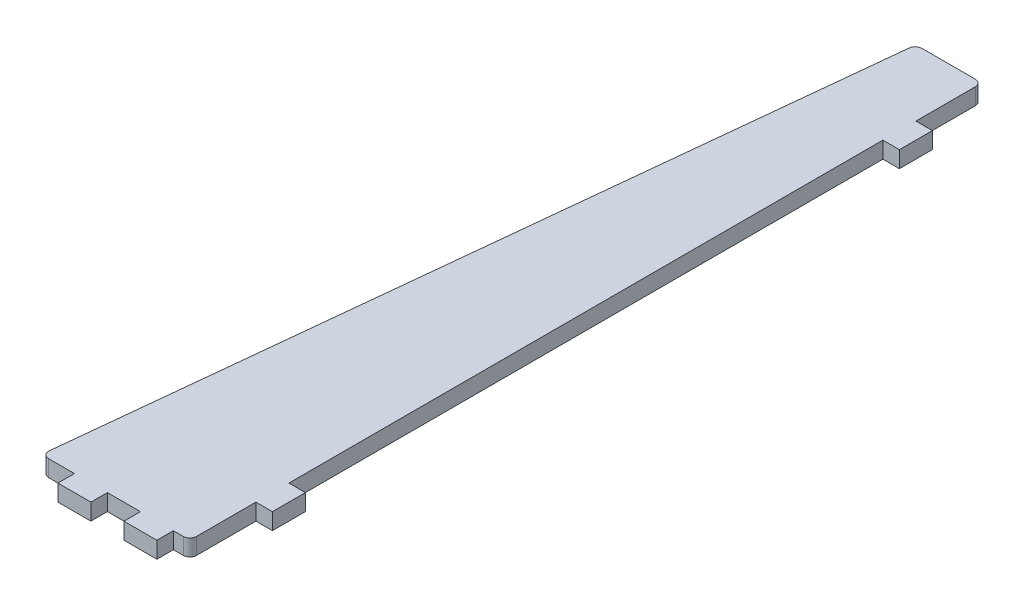
ISO-10303-21;
HEADER;
FILE_DESCRIPTION(('STEP AP214'),'2;1');
FILE_NAME('part.step','',(''),(''),'','','');
FILE_SCHEMA(('AUTOMOTIVE_DESIGN { 1 0 10303 214 1 1 1 1 }'));
ENDSEC;
DATA;
#1=APPLICATION_CONTEXT('core data for automotive mechanical design processes');
#2=APPLICATION_PROTOCOL_DEFINITION('international standard','automotive_design',2000,#1);
#3=PRODUCT_CONTEXT('',#1,'mechanical');
#4=PRODUCT('Part','Part','',(#3));
#5=PRODUCT_RELATED_PRODUCT_CATEGORY('part','',(#4));
#6=PRODUCT_DEFINITION_FORMATION('','',#4);
#7=PRODUCT_DEFINITION_CONTEXT('part definition',#1,'design');
#8=PRODUCT_DEFINITION('design','',#6,#7);
#9=PRODUCT_DEFINITION_SHAPE('','',#8);
#10=(LENGTH_UNIT() NAMED_UNIT(*) SI_UNIT(.MILLI.,.METRE.));
#11=(NAMED_UNIT(*) PLANE_ANGLE_UNIT() SI_UNIT($,.RADIAN.));
#12=(NAMED_UNIT(*) SI_UNIT($,.STERADIAN.) SOLID_ANGLE_UNIT());
#13=UNCERTAINTY_MEASURE_WITH_UNIT(LENGTH_MEASURE(1.E-05),#10,'distance_accuracy_value','');
#14=(GEOMETRIC_REPRESENTATION_CONTEXT(3) GLOBAL_UNCERTAINTY_ASSIGNED_CONTEXT((#13)) GLOBAL_UNIT_ASSIGNED_CONTEXT((#10,
#11,#12)) REPRESENTATION_CONTEXT('',''));
#15=CARTESIAN_POINT('',(0.,0.,0.));
#16=DIRECTION('',(0.,0.,1.));
#17=DIRECTION('',(1.,0.,0.));
#18=AXIS2_PLACEMENT_3D('',#15,#16,#17);
#19=CARTESIAN_POINT('',(31.75,6.35,-304.8));
#20=DIRECTION('',(0.994618408890778,0.,0.103606084259456));
#21=DIRECTION('',(0.103606084259456,0.,-0.994618408890778));
#22=AXIS2_PLACEMENT_3D('',#19,#20,#21);
#23=PLANE('',#22);
#24=DIRECTION('',(-0.103606084259456,0.,0.994618408890778));
#25=VECTOR('',#24,1.);
#26=CARTESIAN_POINT('',(31.75,6.35,-304.8));
#27=LINE('',#26,#25);
#28=CARTESIAN_POINT('',(31.5128291097936,6.35,-302.523159454019));
#29=VERTEX_POINT('',#28);
#30=CARTESIAN_POINT('',(0.291995776460316,6.35,-2.80315945401904));
#31=VERTEX_POINT('',#30);
#32=EDGE_CURVE('E205',#29,#31,#27,.T.);
#33=ORIENTED_EDGE('',*,*,#32,.F.);
#34=DIRECTION('',(0.,-1.,0.));
#35=VECTOR('',#34,1.);
#36=CARTESIAN_POINT('',(31.5128291097936,6.35,-302.523159454019));
#37=LINE('',#36,#35);
#38=CARTESIAN_POINT('',(31.5128291097936,0.,-302.523159454019));
#39=VERTEX_POINT('',#38);
#40=EDGE_CURVE('E40',#29,#39,#37,.T.);
#41=ORIENTED_EDGE('',*,*,#40,.T.);
#42=DIRECTION('',(-0.103606084259456,0.,0.994618408890778));
#43=VECTOR('',#42,1.);
#44=CARTESIAN_POINT('',(31.75,0.,-304.8));
#45=LINE('',#44,#43);
#46=CARTESIAN_POINT('',(0.291995776460316,0.,-2.80315945401904));
#47=VERTEX_POINT('',#46);
#48=EDGE_CURVE('E258',#39,#47,#45,.T.);
#49=ORIENTED_EDGE('',*,*,#48,.T.);
#50=DIRECTION('',(0.,-1.,0.));
#51=VECTOR('',#50,1.);
#52=CARTESIAN_POINT('',(0.291995776460316,6.35,-2.80315945401904));
#53=LINE('',#52,#51);
#54=EDGE_CURVE('E366',#47,#31,#53,.F.);
#55=ORIENTED_EDGE('',*,*,#54,.T.);
#56=EDGE_LOOP('',(#33,#41,#49,#55));
#57=FACE_BOUND('',#56,.T.);
#58=ADVANCED_FACE('F32',(#57),#23,.F.);
#59=CARTESIAN_POINT('',(0.,6.35,0.));
#60=DIRECTION('',(0.,0.,-1.));
#61=DIRECTION('',(-1.,0.,0.));
#62=AXIS2_PLACEMENT_3D('',#59,#60,#61);
#63=PLANE('',#62);
#64=DIRECTION('',(1.,0.,0.));
#65=VECTOR('',#64,1.);
#66=CARTESIAN_POINT('',(0.,6.35,0.));
#67=LINE('',#66,#65);
#68=CARTESIAN_POINT('',(2.81832653504289,6.35,0.));
#69=VERTEX_POINT('',#68);
#70=CARTESIAN_POINT('',(12.7,6.35,0.));
#71=VERTEX_POINT('',#70);
#72=EDGE_CURVE('E193',#69,#71,#67,.T.);
#73=ORIENTED_EDGE('',*,*,#72,.F.);
#74=DIRECTION('',(0.,-1.,0.));
#75=VECTOR('',#74,1.);
#76=CARTESIAN_POINT('',(2.81832653504289,6.35,0.));
#77=LINE('',#76,#75);
#78=CARTESIAN_POINT('',(2.81832653504289,0.,0.));
#79=VERTEX_POINT('',#78);
#80=EDGE_CURVE('E11',#69,#79,#77,.T.);
#81=ORIENTED_EDGE('',*,*,#80,.T.);
#82=DIRECTION('',(1.,0.,0.));
#83=VECTOR('',#82,1.);
#84=CARTESIAN_POINT('',(0.,0.,0.));
#85=LINE('',#84,#83);
#86=CARTESIAN_POINT('',(12.7,0.,0.));
#87=VERTEX_POINT('',#86);
#88=EDGE_CURVE('E211',#79,#87,#85,.T.);
#89=ORIENTED_EDGE('',*,*,#88,.T.);
#90=DIRECTION('',(0.,-1.,0.));
#91=VECTOR('',#90,1.);
#92=CARTESIAN_POINT('',(12.7,6.35,0.));
#93=LINE('',#92,#91);
#94=EDGE_CURVE('E208',#71,#87,#93,.T.);
#95=ORIENTED_EDGE('',*,*,#94,.F.);
#96=EDGE_LOOP('',(#73,#81,#89,#95));
#97=FACE_BOUND('',#96,.T.);
#98=ADVANCED_FACE('F209',(#97),#63,.F.);
#99=CARTESIAN_POINT('',(12.7,6.35,0.));
#100=DIRECTION('',(1.,0.,0.));
#101=DIRECTION('',(0.,0.,-1.));
#102=AXIS2_PLACEMENT_3D('',#99,#100,#101);
#103=PLANE('',#102);
#104=DIRECTION('',(0.,0.,1.));
#105=VECTOR('',#104,1.);
#106=CARTESIAN_POINT('',(12.7,0.,0.));
#107=LINE('',#106,#105);
#108=CARTESIAN_POINT('',(12.7,0.,6.35));
#109=VERTEX_POINT('',#108);
#110=EDGE_CURVE('E262',#87,#109,#107,.T.);
#111=ORIENTED_EDGE('',*,*,#110,.T.);
#112=DIRECTION('',(0.,-1.,0.));
#113=VECTOR('',#112,1.);
#114=CARTESIAN_POINT('',(12.7,6.35,6.35));
#115=LINE('',#114,#113);
#116=CARTESIAN_POINT('',(12.7,6.35,6.35));
#117=VERTEX_POINT('',#116);
#118=EDGE_CURVE('E215',#117,#109,#115,.T.);
#119=ORIENTED_EDGE('',*,*,#118,.F.);
#120=DIRECTION('',(0.,0.,1.));
#121=VECTOR('',#120,1.);
#122=CARTESIAN_POINT('',(12.7,6.35,0.));
#123=LINE('',#122,#121);
#124=EDGE_CURVE('E198',#71,#117,#123,.T.);
#125=ORIENTED_EDGE('',*,*,#124,.F.);
#126=ORIENTED_EDGE('',*,*,#94,.T.);
#127=EDGE_LOOP('',(#111,#119,#125,#126));
#128=FACE_BOUND('',#127,.T.);
#129=ADVANCED_FACE('F217',(#128),#103,.F.);
#130=CARTESIAN_POINT('',(12.7,6.35,6.35));
#131=DIRECTION('',(0.,0.,-1.));
#132=DIRECTION('',(-1.,0.,0.));
#133=AXIS2_PLACEMENT_3D('',#130,#131,#132);
#134=PLANE('',#133);
#135=DIRECTION('',(1.,0.,0.));
#136=VECTOR('',#135,1.);
#137=CARTESIAN_POINT('',(12.7,0.,6.35));
#138=LINE('',#137,#136);
#139=CARTESIAN_POINT('',(25.4,0.,6.35));
#140=VERTEX_POINT('',#139);
#141=EDGE_CURVE('E264',#109,#140,#138,.T.);
#142=ORIENTED_EDGE('',*,*,#141,.T.);
#143=DIRECTION('',(0.,-1.,0.));
#144=VECTOR('',#143,1.);
#145=CARTESIAN_POINT('',(25.4,6.35,6.35));
#146=LINE('',#145,#144);
#147=CARTESIAN_POINT('',(25.4,6.35,6.35));
#148=VERTEX_POINT('',#147);
#149=EDGE_CURVE('E338',#148,#140,#146,.T.);
#150=ORIENTED_EDGE('',*,*,#149,.F.);
#151=DIRECTION('',(1.,0.,0.));
#152=VECTOR('',#151,1.);
#153=CARTESIAN_POINT('',(12.7,6.35,6.35));
#154=LINE('',#153,#152);
#155=EDGE_CURVE('E220',#117,#148,#154,.T.);
#156=ORIENTED_EDGE('',*,*,#155,.F.);
#157=ORIENTED_EDGE('',*,*,#118,.T.);
#158=EDGE_LOOP('',(#142,#150,#156,#157));
#159=FACE_BOUND('',#158,.T.);
#160=ADVANCED_FACE('F500',(#159),#134,.F.);
#161=CARTESIAN_POINT('',(25.4,6.35,6.35));
#162=DIRECTION('',(-1.,0.,0.));
#163=DIRECTION('',(0.,0.,1.));
#164=AXIS2_PLACEMENT_3D('',#161,#162,#163);
#165=PLANE('',#164);
#166=DIRECTION('',(0.,0.,-1.));
#167=VECTOR('',#166,1.);
#168=CARTESIAN_POINT('',(25.4,0.,6.35));
#169=LINE('',#168,#167);
#170=CARTESIAN_POINT('',(25.4,0.,0.));
#171=VERTEX_POINT('',#170);
#172=EDGE_CURVE('E266',#140,#171,#169,.T.);
#173=ORIENTED_EDGE('',*,*,#172,.T.);
#174=DIRECTION('',(0.,-1.,0.));
#175=VECTOR('',#174,1.);
#176=CARTESIAN_POINT('',(25.4,6.35,0.));
#177=LINE('',#176,#175);
#178=CARTESIAN_POINT('',(25.4,6.35,0.));
#179=VERTEX_POINT('',#178);
#180=EDGE_CURVE('E335',#179,#171,#177,.T.);
#181=ORIENTED_EDGE('',*,*,#180,.F.);
#182=DIRECTION('',(0.,0.,-1.));
#183=VECTOR('',#182,1.);
#184=CARTESIAN_POINT('',(25.4,6.35,6.35));
#185=LINE('',#184,#183);
#186=EDGE_CURVE('E222',#148,#179,#185,.T.);
#187=ORIENTED_EDGE('',*,*,#186,.F.);
#188=ORIENTED_EDGE('',*,*,#149,.T.);
#189=EDGE_LOOP('',(#173,#181,#187,#188));
#190=FACE_BOUND('',#189,.T.);
#191=ADVANCED_FACE('F496',(#190),#165,.F.);
#192=CARTESIAN_POINT('',(25.4,6.35,0.));
#193=DIRECTION('',(0.,0.,-1.));
#194=DIRECTION('',(-1.,0.,0.));
#195=AXIS2_PLACEMENT_3D('',#192,#193,#194);
#196=PLANE('',#195);
#197=DIRECTION('',(1.,0.,0.));
#198=VECTOR('',#197,1.);
#199=CARTESIAN_POINT('',(25.4,0.,0.));
#200=LINE('',#199,#198);
#201=CARTESIAN_POINT('',(38.1,0.,0.));
#202=VERTEX_POINT('',#201);
#203=EDGE_CURVE('E268',#171,#202,#200,.T.);
#204=ORIENTED_EDGE('',*,*,#203,.T.);
#205=DIRECTION('',(0.,-1.,0.));
#206=VECTOR('',#205,1.);
#207=CARTESIAN_POINT('',(38.1,6.35,0.));
#208=LINE('',#207,#206);
#209=CARTESIAN_POINT('',(38.1,6.35,0.));
#210=VERTEX_POINT('',#209);
#211=EDGE_CURVE('E332',#210,#202,#208,.T.);
#212=ORIENTED_EDGE('',*,*,#211,.F.);
#213=DIRECTION('',(1.,0.,0.));
#214=VECTOR('',#213,1.);
#215=CARTESIAN_POINT('',(25.4,6.35,0.));
#216=LINE('',#215,#214);
#217=EDGE_CURVE('E227',#179,#210,#216,.T.);
#218=ORIENTED_EDGE('',*,*,#217,.F.);
#219=ORIENTED_EDGE('',*,*,#180,.T.);
#220=EDGE_LOOP('',(#204,#212,#218,#219));
#221=FACE_BOUND('',#220,.T.);
#222=ADVANCED_FACE('F492',(#221),#196,.F.);
#223=CARTESIAN_POINT('',(38.1,6.35,0.));
#224=DIRECTION('',(1.,0.,0.));
#225=DIRECTION('',(0.,0.,-1.));
#226=AXIS2_PLACEMENT_3D('',#223,#224,#225);
#227=PLANE('',#226);
#228=DIRECTION('',(0.,0.,1.));
#229=VECTOR('',#228,1.);
#230=CARTESIAN_POINT('',(38.1,0.,0.));
#231=LINE('',#230,#229);
#232=CARTESIAN_POINT('',(38.1,0.,6.35));
#233=VERTEX_POINT('',#232);
#234=EDGE_CURVE('E270',#202,#233,#231,.T.);
#235=ORIENTED_EDGE('',*,*,#234,.T.);
#236=DIRECTION('',(0.,-1.,0.));
#237=VECTOR('',#236,1.);
#238=CARTESIAN_POINT('',(38.1,6.35,6.35));
#239=LINE('',#238,#237);
#240=CARTESIAN_POINT('',(38.1,6.35,6.35));
#241=VERTEX_POINT('',#240);
#242=EDGE_CURVE('E329',#241,#233,#239,.T.);
#243=ORIENTED_EDGE('',*,*,#242,.F.);
#244=DIRECTION('',(0.,0.,1.));
#245=VECTOR('',#244,1.);
#246=CARTESIAN_POINT('',(38.1,6.35,0.));
#247=LINE('',#246,#245);
#248=EDGE_CURVE('E229',#210,#241,#247,.T.);
#249=ORIENTED_EDGE('',*,*,#248,.F.);
#250=ORIENTED_EDGE('',*,*,#211,.T.);
#251=EDGE_LOOP('',(#235,#243,#249,#250));
#252=FACE_BOUND('',#251,.T.);
#253=ADVANCED_FACE('F488',(#252),#227,.F.);
#254=CARTESIAN_POINT('',(38.1,6.35,6.35));
#255=DIRECTION('',(0.,0.,-1.));
#256=DIRECTION('',(-1.,0.,0.));
#257=AXIS2_PLACEMENT_3D('',#254,#255,#256);
#258=PLANE('',#257);
#259=DIRECTION('',(1.,0.,0.));
#260=VECTOR('',#259,1.);
#261=CARTESIAN_POINT('',(38.1,0.,6.35));
#262=LINE('',#261,#260);
#263=CARTESIAN_POINT('',(50.8,0.,6.35));
#264=VERTEX_POINT('',#263);
#265=EDGE_CURVE('E272',#233,#264,#262,.T.);
#266=ORIENTED_EDGE('',*,*,#265,.T.);
#267=DIRECTION('',(0.,-1.,0.));
#268=VECTOR('',#267,1.);
#269=CARTESIAN_POINT('',(50.8,6.35,6.35));
#270=LINE('',#269,#268);
#271=CARTESIAN_POINT('',(50.8,6.35,6.35));
#272=VERTEX_POINT('',#271);
#273=EDGE_CURVE('E326',#272,#264,#270,.T.);
#274=ORIENTED_EDGE('',*,*,#273,.F.);
#275=DIRECTION('',(1.,0.,0.));
#276=VECTOR('',#275,1.);
#277=CARTESIAN_POINT('',(38.1,6.35,6.35));
#278=LINE('',#277,#276);
#279=EDGE_CURVE('E231',#241,#272,#278,.T.);
#280=ORIENTED_EDGE('',*,*,#279,.F.);
#281=ORIENTED_EDGE('',*,*,#242,.T.);
#282=EDGE_LOOP('',(#266,#274,#280,#281));
#283=FACE_BOUND('',#282,.T.);
#284=ADVANCED_FACE('F484',(#283),#258,.F.);
#285=CARTESIAN_POINT('',(50.8,6.35,6.35));
#286=DIRECTION('',(-1.,0.,0.));
#287=DIRECTION('',(0.,0.,1.));
#288=AXIS2_PLACEMENT_3D('',#285,#286,#287);
#289=PLANE('',#288);
#290=DIRECTION('',(0.,0.,-1.));
#291=VECTOR('',#290,1.);
#292=CARTESIAN_POINT('',(50.8,0.,6.35));
#293=LINE('',#292,#291);
#294=CARTESIAN_POINT('',(50.8,0.,0.));
#295=VERTEX_POINT('',#294);
#296=EDGE_CURVE('E274',#264,#295,#293,.T.);
#297=ORIENTED_EDGE('',*,*,#296,.T.);
#298=DIRECTION('',(0.,-1.,0.));
#299=VECTOR('',#298,1.);
#300=CARTESIAN_POINT('',(50.8,6.35,0.));
#301=LINE('',#300,#299);
#302=CARTESIAN_POINT('',(50.8,6.35,0.));
#303=VERTEX_POINT('',#302);
#304=EDGE_CURVE('E323',#303,#295,#301,.T.);
#305=ORIENTED_EDGE('',*,*,#304,.F.);
#306=DIRECTION('',(0.,0.,-1.));
#307=VECTOR('',#306,1.);
#308=CARTESIAN_POINT('',(50.8,6.35,6.35));
#309=LINE('',#308,#307);
#310=EDGE_CURVE('E233',#272,#303,#309,.T.);
#311=ORIENTED_EDGE('',*,*,#310,.F.);
#312=ORIENTED_EDGE('',*,*,#273,.T.);
#313=EDGE_LOOP('',(#297,#305,#311,#312));
#314=FACE_BOUND('',#313,.T.);
#315=ADVANCED_FACE('F480',(#314),#289,.F.);
#316=CARTESIAN_POINT('',(50.8,6.35,0.));
#317=DIRECTION('',(0.,0.,-1.));
#318=DIRECTION('',(-1.,0.,0.));
#319=AXIS2_PLACEMENT_3D('',#316,#317,#318);
#320=PLANE('',#319);
#321=DIRECTION('',(1.,0.,0.));
#322=VECTOR('',#321,1.);
#323=CARTESIAN_POINT('',(50.8,0.,0.));
#324=LINE('',#323,#322);
#325=CARTESIAN_POINT('',(54.61,0.,0.));
#326=VERTEX_POINT('',#325);
#327=EDGE_CURVE('E276',#295,#326,#324,.T.);
#328=ORIENTED_EDGE('',*,*,#327,.T.);
#329=DIRECTION('',(0.,-1.,0.));
#330=VECTOR('',#329,1.);
#331=CARTESIAN_POINT('',(54.61,6.35,0.));
#332=LINE('',#331,#330);
#333=CARTESIAN_POINT('',(54.61,6.35,0.));
#334=VERTEX_POINT('',#333);
#335=EDGE_CURVE('E352',#326,#334,#332,.F.);
#336=ORIENTED_EDGE('',*,*,#335,.T.);
#337=DIRECTION('',(1.,0.,0.));
#338=VECTOR('',#337,1.);
#339=CARTESIAN_POINT('',(50.8,6.35,0.));
#340=LINE('',#339,#338);
#341=EDGE_CURVE('E235',#303,#334,#340,.T.);
#342=ORIENTED_EDGE('',*,*,#341,.F.);
#343=ORIENTED_EDGE('',*,*,#304,.T.);
#344=EDGE_LOOP('',(#328,#336,#342,#343));
#345=FACE_BOUND('',#344,.T.);
#346=ADVANCED_FACE('F477',(#345),#320,.F.);
#347=CARTESIAN_POINT('',(57.15,6.35,0.));
#348=DIRECTION('',(-1.,0.,0.));
#349=DIRECTION('',(0.,0.,1.));
#350=AXIS2_PLACEMENT_3D('',#347,#348,#349);
#351=PLANE('',#350);
#352=DIRECTION('',(0.,0.,-1.));
#353=VECTOR('',#352,1.);
#354=CARTESIAN_POINT('',(57.15,6.35,0.));
#355=LINE('',#354,#353);
#356=CARTESIAN_POINT('',(57.15,6.35,-2.54));
#357=VERTEX_POINT('',#356);
#358=CARTESIAN_POINT('',(57.15,6.35,-25.4));
#359=VERTEX_POINT('',#358);
#360=EDGE_CURVE('E237',#357,#359,#355,.T.);
#361=ORIENTED_EDGE('',*,*,#360,.F.);
#362=DIRECTION('',(0.,-1.,0.));
#363=VECTOR('',#362,1.);
#364=CARTESIAN_POINT('',(57.15,6.35,-2.54));
#365=LINE('',#364,#363);
#366=CARTESIAN_POINT('',(57.15,0.,-2.54));
#367=VERTEX_POINT('',#366);
#368=EDGE_CURVE('E214',#357,#367,#365,.T.);
#369=ORIENTED_EDGE('',*,*,#368,.T.);
#370=DIRECTION('',(0.,0.,-1.));
#371=VECTOR('',#370,1.);
#372=CARTESIAN_POINT('',(57.15,0.,0.));
#373=LINE('',#372,#371);
#374=CARTESIAN_POINT('',(57.15,0.,-25.4));
#375=VERTEX_POINT('',#374);
#376=EDGE_CURVE('E279',#367,#375,#373,.T.);
#377=ORIENTED_EDGE('',*,*,#376,.T.);
#378=DIRECTION('',(0.,-1.,0.));
#379=VECTOR('',#378,1.);
#380=CARTESIAN_POINT('',(57.15,6.35,-25.4));
#381=LINE('',#380,#379);
#382=EDGE_CURVE('E320',#359,#375,#381,.T.);
#383=ORIENTED_EDGE('',*,*,#382,.F.);
#384=EDGE_LOOP('',(#361,#369,#377,#383));
#385=FACE_BOUND('',#384,.T.);
#386=ADVANCED_FACE('F411',(#385),#351,.F.);
#387=CARTESIAN_POINT('',(57.15,6.35,-25.4));
#388=DIRECTION('',(0.,0.,-1.));
#389=DIRECTION('',(-1.,0.,0.));
#390=AXIS2_PLACEMENT_3D('',#387,#388,#389);
#391=PLANE('',#390);
#392=DIRECTION('',(1.,0.,0.));
#393=VECTOR('',#392,1.);
#394=CARTESIAN_POINT('',(57.15,0.,-25.4));
#395=LINE('',#394,#393);
#396=CARTESIAN_POINT('',(63.5,0.,-25.4));
#397=VERTEX_POINT('',#396);
#398=EDGE_CURVE('E281',#375,#397,#395,.T.);
#399=ORIENTED_EDGE('',*,*,#398,.T.);
#400=DIRECTION('',(0.,-1.,0.));
#401=VECTOR('',#400,1.);
#402=CARTESIAN_POINT('',(63.5,6.35,-25.4));
#403=LINE('',#402,#401);
#404=CARTESIAN_POINT('',(63.5,6.35,-25.4));
#405=VERTEX_POINT('',#404);
#406=EDGE_CURVE('E317',#405,#397,#403,.T.);
#407=ORIENTED_EDGE('',*,*,#406,.F.);
#408=DIRECTION('',(1.,0.,0.));
#409=VECTOR('',#408,1.);
#410=CARTESIAN_POINT('',(57.15,6.35,-25.4));
#411=LINE('',#410,#409);
#412=EDGE_CURVE('E239',#359,#405,#411,.T.);
#413=ORIENTED_EDGE('',*,*,#412,.F.);
#414=ORIENTED_EDGE('',*,*,#382,.T.);
#415=EDGE_LOOP('',(#399,#407,#413,#414));
#416=FACE_BOUND('',#415,.T.);
#417=ADVANCED_FACE('F416',(#416),#391,.F.);
#418=CARTESIAN_POINT('',(63.5,6.35,-25.4));
#419=DIRECTION('',(-1.,0.,0.));
#420=DIRECTION('',(0.,0.,1.));
#421=AXIS2_PLACEMENT_3D('',#418,#419,#420);
#422=PLANE('',#421);
#423=DIRECTION('',(0.,0.,-1.));
#424=VECTOR('',#423,1.);
#425=CARTESIAN_POINT('',(63.5,0.,-25.4));
#426=LINE('',#425,#424);
#427=CARTESIAN_POINT('',(63.5,0.,-38.1));
#428=VERTEX_POINT('',#427);
#429=EDGE_CURVE('E283',#397,#428,#426,.T.);
#430=ORIENTED_EDGE('',*,*,#429,.T.);
#431=DIRECTION('',(0.,-1.,0.));
#432=VECTOR('',#431,1.);
#433=CARTESIAN_POINT('',(63.5,6.35,-38.1));
#434=LINE('',#433,#432);
#435=CARTESIAN_POINT('',(63.5,6.35,-38.1));
#436=VERTEX_POINT('',#435);
#437=EDGE_CURVE('E314',#436,#428,#434,.T.);
#438=ORIENTED_EDGE('',*,*,#437,.F.);
#439=DIRECTION('',(0.,0.,-1.));
#440=VECTOR('',#439,1.);
#441=CARTESIAN_POINT('',(63.5,6.35,-25.4));
#442=LINE('',#441,#440);
#443=EDGE_CURVE('E241',#405,#436,#442,.T.);
#444=ORIENTED_EDGE('',*,*,#443,.F.);
#445=ORIENTED_EDGE('',*,*,#406,.T.);
#446=EDGE_LOOP('',(#430,#438,#444,#445));
#447=FACE_BOUND('',#446,.T.);
#448=ADVANCED_FACE('F422',(#447),#422,.F.);
#449=CARTESIAN_POINT('',(63.5,6.35,-38.1));
#450=DIRECTION('',(0.,0.,1.));
#451=DIRECTION('',(1.,0.,0.));
#452=AXIS2_PLACEMENT_3D('',#449,#450,#451);
#453=PLANE('',#452);
#454=DIRECTION('',(-1.,0.,0.));
#455=VECTOR('',#454,1.);
#456=CARTESIAN_POINT('',(63.5,0.,-38.1));
#457=LINE('',#456,#455);
#458=CARTESIAN_POINT('',(57.15,0.,-38.1));
#459=VERTEX_POINT('',#458);
#460=EDGE_CURVE('E285',#428,#459,#457,.T.);
#461=ORIENTED_EDGE('',*,*,#460,.T.);
#462=DIRECTION('',(0.,-1.,0.));
#463=VECTOR('',#462,1.);
#464=CARTESIAN_POINT('',(57.15,6.35,-38.1));
#465=LINE('',#464,#463);
#466=CARTESIAN_POINT('',(57.15,6.35,-38.1));
#467=VERTEX_POINT('',#466);
#468=EDGE_CURVE('E311',#467,#459,#465,.T.);
#469=ORIENTED_EDGE('',*,*,#468,.F.);
#470=DIRECTION('',(-1.,0.,0.));
#471=VECTOR('',#470,1.);
#472=CARTESIAN_POINT('',(63.5,6.35,-38.1));
#473=LINE('',#472,#471);
#474=EDGE_CURVE('E243',#436,#467,#473,.T.);
#475=ORIENTED_EDGE('',*,*,#474,.F.);
#476=ORIENTED_EDGE('',*,*,#437,.T.);
#477=EDGE_LOOP('',(#461,#469,#475,#476));
#478=FACE_BOUND('',#477,.T.);
#479=ADVANCED_FACE('F426',(#478),#453,.F.);
#480=CARTESIAN_POINT('',(57.15,6.35,-38.1));
#481=DIRECTION('',(-1.,0.,0.));
#482=DIRECTION('',(0.,0.,1.));
#483=AXIS2_PLACEMENT_3D('',#480,#481,#482);
#484=PLANE('',#483);
#485=DIRECTION('',(0.,0.,-1.));
#486=VECTOR('',#485,1.);
#487=CARTESIAN_POINT('',(57.15,0.,-38.1));
#488=LINE('',#487,#486);
#489=CARTESIAN_POINT('',(57.15,0.,-266.7));
#490=VERTEX_POINT('',#489);
#491=EDGE_CURVE('E287',#459,#490,#488,.T.);
#492=ORIENTED_EDGE('',*,*,#491,.T.);
#493=DIRECTION('',(0.,-1.,0.));
#494=VECTOR('',#493,1.);
#495=CARTESIAN_POINT('',(57.15,6.35,-266.7));
#496=LINE('',#495,#494);
#497=CARTESIAN_POINT('',(57.15,6.35,-266.7));
#498=VERTEX_POINT('',#497);
#499=EDGE_CURVE('E308',#498,#490,#496,.T.);
#500=ORIENTED_EDGE('',*,*,#499,.F.);
#501=DIRECTION('',(0.,0.,-1.));
#502=VECTOR('',#501,1.);
#503=CARTESIAN_POINT('',(57.15,6.35,-38.1));
#504=LINE('',#503,#502);
#505=EDGE_CURVE('E245',#467,#498,#504,.T.);
#506=ORIENTED_EDGE('',*,*,#505,.F.);
#507=ORIENTED_EDGE('',*,*,#468,.T.);
#508=EDGE_LOOP('',(#492,#500,#506,#507));
#509=FACE_BOUND('',#508,.T.);
#510=ADVANCED_FACE('F431',(#509),#484,.F.);
#511=CARTESIAN_POINT('',(57.15,6.35,-266.7));
#512=DIRECTION('',(0.,0.,-1.));
#513=DIRECTION('',(-1.,0.,0.));
#514=AXIS2_PLACEMENT_3D('',#511,#512,#513);
#515=PLANE('',#514);
#516=DIRECTION('',(1.,0.,0.));
#517=VECTOR('',#516,1.);
#518=CARTESIAN_POINT('',(57.15,0.,-266.7));
#519=LINE('',#518,#517);
#520=CARTESIAN_POINT('',(63.5,0.,-266.7));
#521=VERTEX_POINT('',#520);
#522=EDGE_CURVE('E289',#490,#521,#519,.T.);
#523=ORIENTED_EDGE('',*,*,#522,.T.);
#524=DIRECTION('',(0.,-1.,0.));
#525=VECTOR('',#524,1.);
#526=CARTESIAN_POINT('',(63.5,6.35,-266.7));
#527=LINE('',#526,#525);
#528=CARTESIAN_POINT('',(63.5,6.35,-266.7));
#529=VERTEX_POINT('',#528);
#530=EDGE_CURVE('E305',#529,#521,#527,.T.);
#531=ORIENTED_EDGE('',*,*,#530,.F.);
#532=DIRECTION('',(1.,0.,0.));
#533=VECTOR('',#532,1.);
#534=CARTESIAN_POINT('',(57.15,6.35,-266.7));
#535=LINE('',#534,#533);
#536=EDGE_CURVE('E247',#498,#529,#535,.T.);
#537=ORIENTED_EDGE('',*,*,#536,.F.);
#538=ORIENTED_EDGE('',*,*,#499,.T.);
#539=EDGE_LOOP('',(#523,#531,#537,#538));
#540=FACE_BOUND('',#539,.T.);
#541=ADVANCED_FACE('F437',(#540),#515,.F.);
#542=CARTESIAN_POINT('',(63.5,6.35,-266.7));
#543=DIRECTION('',(-1.,0.,0.));
#544=DIRECTION('',(0.,0.,1.));
#545=AXIS2_PLACEMENT_3D('',#542,#543,#544);
#546=PLANE('',#545);
#547=DIRECTION('',(0.,0.,-1.));
#548=VECTOR('',#547,1.);
#549=CARTESIAN_POINT('',(63.5,0.,-266.7));
#550=LINE('',#549,#548);
#551=CARTESIAN_POINT('',(63.5,0.,-279.4));
#552=VERTEX_POINT('',#551);
#553=EDGE_CURVE('E291',#521,#552,#550,.T.);
#554=ORIENTED_EDGE('',*,*,#553,.T.);
#555=DIRECTION('',(0.,-1.,0.));
#556=VECTOR('',#555,1.);
#557=CARTESIAN_POINT('',(63.5,6.35,-279.4));
#558=LINE('',#557,#556);
#559=CARTESIAN_POINT('',(63.5,6.35,-279.4));
#560=VERTEX_POINT('',#559);
#561=EDGE_CURVE('E302',#560,#552,#558,.T.);
#562=ORIENTED_EDGE('',*,*,#561,.F.);
#563=DIRECTION('',(0.,0.,-1.));
#564=VECTOR('',#563,1.);
#565=CARTESIAN_POINT('',(63.5,6.35,-266.7));
#566=LINE('',#565,#564);
#567=EDGE_CURVE('E249',#529,#560,#566,.T.);
#568=ORIENTED_EDGE('',*,*,#567,.F.);
#569=ORIENTED_EDGE('',*,*,#530,.T.);
#570=EDGE_LOOP('',(#554,#562,#568,#569));
#571=FACE_BOUND('',#570,.T.);
#572=ADVANCED_FACE('F441',(#571),#546,.F.);
#573=CARTESIAN_POINT('',(63.5,6.35,-279.4));
#574=DIRECTION('',(0.,0.,1.));
#575=DIRECTION('',(1.,0.,0.));
#576=AXIS2_PLACEMENT_3D('',#573,#574,#575);
#577=PLANE('',#576);
#578=DIRECTION('',(-1.,0.,0.));
#579=VECTOR('',#578,1.);
#580=CARTESIAN_POINT('',(63.5,0.,-279.4));
#581=LINE('',#580,#579);
#582=CARTESIAN_POINT('',(57.15,0.,-279.4));
#583=VERTEX_POINT('',#582);
#584=EDGE_CURVE('E293',#552,#583,#581,.T.);
#585=ORIENTED_EDGE('',*,*,#584,.T.);
#586=DIRECTION('',(0.,-1.,0.));
#587=VECTOR('',#586,1.);
#588=CARTESIAN_POINT('',(57.15,6.35,-279.4));
#589=LINE('',#588,#587);
#590=CARTESIAN_POINT('',(57.15,6.35,-279.4));
#591=VERTEX_POINT('',#590);
#592=EDGE_CURVE('E257',#591,#583,#589,.T.);
#593=ORIENTED_EDGE('',*,*,#592,.F.);
#594=DIRECTION('',(-1.,0.,0.));
#595=VECTOR('',#594,1.);
#596=CARTESIAN_POINT('',(63.5,6.35,-279.4));
#597=LINE('',#596,#595);
#598=EDGE_CURVE('E251',#560,#591,#597,.T.);
#599=ORIENTED_EDGE('',*,*,#598,.F.);
#600=ORIENTED_EDGE('',*,*,#561,.T.);
#601=EDGE_LOOP('',(#585,#593,#599,#600));
#602=FACE_BOUND('',#601,.T.);
#603=ADVANCED_FACE('F446',(#602),#577,.F.);
#604=CARTESIAN_POINT('',(57.15,6.35,-279.4));
#605=DIRECTION('',(-1.,0.,0.));
#606=DIRECTION('',(0.,0.,1.));
#607=AXIS2_PLACEMENT_3D('',#604,#605,#606);
#608=PLANE('',#607);
#609=DIRECTION('',(0.,0.,-1.));
#610=VECTOR('',#609,1.);
#611=CARTESIAN_POINT('',(57.15,0.,-279.4));
#612=LINE('',#611,#610);
#613=CARTESIAN_POINT('',(57.15,0.,-302.26));
#614=VERTEX_POINT('',#613);
#615=EDGE_CURVE('E295',#583,#614,#612,.T.);
#616=ORIENTED_EDGE('',*,*,#615,.T.);
#617=DIRECTION('',(0.,-1.,0.));
#618=VECTOR('',#617,1.);
#619=CARTESIAN_POINT('',(57.15,6.35,-302.26));
#620=LINE('',#619,#618);
#621=CARTESIAN_POINT('',(57.15,6.35,-302.26));
#622=VERTEX_POINT('',#621);
#623=EDGE_CURVE('E364',#614,#622,#620,.F.);
#624=ORIENTED_EDGE('',*,*,#623,.T.);
#625=DIRECTION('',(0.,0.,-1.));
#626=VECTOR('',#625,1.);
#627=CARTESIAN_POINT('',(57.15,6.35,-279.4));
#628=LINE('',#627,#626);
#629=EDGE_CURVE('E253',#591,#622,#628,.T.);
#630=ORIENTED_EDGE('',*,*,#629,.F.);
#631=ORIENTED_EDGE('',*,*,#592,.T.);
#632=EDGE_LOOP('',(#616,#624,#630,#631));
#633=FACE_BOUND('',#632,.T.);
#634=ADVANCED_FACE('F453',(#633),#608,.F.);
#635=CARTESIAN_POINT('',(57.15,6.35,-304.8));
#636=DIRECTION('',(0.,0.,1.));
#637=DIRECTION('',(1.,0.,0.));
#638=AXIS2_PLACEMENT_3D('',#635,#636,#637);
#639=PLANE('',#638);
#640=DIRECTION('',(-1.,0.,0.));
#641=VECTOR('',#640,1.);
#642=CARTESIAN_POINT('',(57.15,6.35,-304.8));
#643=LINE('',#642,#641);
#644=CARTESIAN_POINT('',(54.61,6.35,-304.8));
#645=VERTEX_POINT('',#644);
#646=CARTESIAN_POINT('',(34.0391598683762,6.35,-304.8));
#647=VERTEX_POINT('',#646);
#648=EDGE_CURVE('E255',#645,#647,#643,.T.);
#649=ORIENTED_EDGE('',*,*,#648,.F.);
#650=DIRECTION('',(0.,-1.,0.));
#651=VECTOR('',#650,1.);
#652=CARTESIAN_POINT('',(54.61,6.35,-304.8));
#653=LINE('',#652,#651);
#654=CARTESIAN_POINT('',(54.61,0.,-304.8));
#655=VERTEX_POINT('',#654);
#656=EDGE_CURVE('E361',#645,#655,#653,.T.);
#657=ORIENTED_EDGE('',*,*,#656,.T.);
#658=DIRECTION('',(-1.,0.,0.));
#659=VECTOR('',#658,1.);
#660=CARTESIAN_POINT('',(57.15,0.,-304.8));
#661=LINE('',#660,#659);
#662=CARTESIAN_POINT('',(34.0391598683762,0.,-304.8));
#663=VERTEX_POINT('',#662);
#664=EDGE_CURVE('E298',#655,#663,#661,.T.);
#665=ORIENTED_EDGE('',*,*,#664,.T.);
#666=DIRECTION('',(0.,-1.,0.));
#667=VECTOR('',#666,1.);
#668=CARTESIAN_POINT('',(34.0391598683762,6.35,-304.8));
#669=LINE('',#668,#667);
#670=EDGE_CURVE('E47',#663,#647,#669,.F.);
#671=ORIENTED_EDGE('',*,*,#670,.T.);
#672=EDGE_LOOP('',(#649,#657,#665,#671));
#673=FACE_BOUND('',#672,.T.);
#674=ADVANCED_FACE('F451',(#673),#639,.F.);
#675=CARTESIAN_POINT('',(0.,6.35,0.));
#676=DIRECTION('',(0.,1.,0.));
#677=DIRECTION('',(0.,0.,1.));
#678=AXIS2_PLACEMENT_3D('',#675,#676,#677);
#679=PLANE('',#678);
#680=ORIENTED_EDGE('',*,*,#341,.T.);
#681=CARTESIAN_POINT('',(54.61,6.35,-2.54));
#682=DIRECTION('',(0.,1.,0.));
#683=DIRECTION('',(0.,0.,1.));
#684=AXIS2_PLACEMENT_3D('',#681,#682,#683);
#685=CIRCLE('',#684,2.54);
#686=EDGE_CURVE('E358',#334,#357,#685,.T.);
#687=ORIENTED_EDGE('',*,*,#686,.T.);
#688=ORIENTED_EDGE('',*,*,#360,.T.);
#689=ORIENTED_EDGE('',*,*,#412,.T.);
#690=ORIENTED_EDGE('',*,*,#443,.T.);
#691=ORIENTED_EDGE('',*,*,#474,.T.);
#692=ORIENTED_EDGE('',*,*,#505,.T.);
#693=ORIENTED_EDGE('',*,*,#536,.T.);
#694=ORIENTED_EDGE('',*,*,#567,.T.);
#695=ORIENTED_EDGE('',*,*,#598,.T.);
#696=ORIENTED_EDGE('',*,*,#629,.T.);
#697=CARTESIAN_POINT('',(54.61,6.35,-302.26));
#698=DIRECTION('',(0.,1.,0.));
#699=DIRECTION('',(0.,0.,1.));
#700=AXIS2_PLACEMENT_3D('',#697,#698,#699);
#701=CIRCLE('',#700,2.54);
#702=EDGE_CURVE('E54',#622,#645,#701,.T.);
#703=ORIENTED_EDGE('',*,*,#702,.T.);
#704=ORIENTED_EDGE('',*,*,#648,.T.);
#705=CARTESIAN_POINT('',(34.0391598683762,6.35,-302.26));
#706=DIRECTION('',(0.,1.,0.));
#707=DIRECTION('',(0.,0.,1.));
#708=AXIS2_PLACEMENT_3D('',#705,#706,#707);
#709=CIRCLE('',#708,2.54);
#710=EDGE_CURVE('E355',#647,#29,#709,.T.);
#711=ORIENTED_EDGE('',*,*,#710,.T.);
#712=ORIENTED_EDGE('',*,*,#32,.T.);
#713=CARTESIAN_POINT('',(2.81832653504289,6.35,-2.54));
#714=DIRECTION('',(0.,1.,0.));
#715=DIRECTION('',(0.,0.,1.));
#716=AXIS2_PLACEMENT_3D('',#713,#714,#715);
#717=CIRCLE('',#716,2.54);
#718=EDGE_CURVE('E202',#31,#69,#717,.T.);
#719=ORIENTED_EDGE('',*,*,#718,.T.);
#720=ORIENTED_EDGE('',*,*,#72,.T.);
#721=ORIENTED_EDGE('',*,*,#124,.T.);
#722=ORIENTED_EDGE('',*,*,#155,.T.);
#723=ORIENTED_EDGE('',*,*,#186,.T.);
#724=ORIENTED_EDGE('',*,*,#217,.T.);
#725=ORIENTED_EDGE('',*,*,#248,.T.);
#726=ORIENTED_EDGE('',*,*,#279,.T.);
#727=ORIENTED_EDGE('',*,*,#310,.T.);
#728=EDGE_LOOP('',(#680,#687,#688,#689,#690,#691,#692,#693,#694,#695,#696,#703,#704,#711,#712,
#719,#720,#721,#722,#723,#724,#725,#726,#727));
#729=FACE_BOUND('',#728,.T.);
#730=ADVANCED_FACE('F196',(#729),#679,.T.);
#731=CARTESIAN_POINT('',(0.,0.,0.));
#732=DIRECTION('',(0.,1.,0.));
#733=DIRECTION('',(0.,0.,1.));
#734=AXIS2_PLACEMENT_3D('',#731,#732,#733);
#735=PLANE('',#734);
#736=ORIENTED_EDGE('',*,*,#376,.F.);
#737=CARTESIAN_POINT('',(54.61,0.,-2.54));
#738=DIRECTION('',(0.,1.,0.));
#739=DIRECTION('',(0.,0.,1.));
#740=AXIS2_PLACEMENT_3D('',#737,#738,#739);
#741=CIRCLE('',#740,2.54);
#742=EDGE_CURVE('E350',#367,#326,#741,.F.);
#743=ORIENTED_EDGE('',*,*,#742,.T.);
#744=ORIENTED_EDGE('',*,*,#327,.F.);
#745=ORIENTED_EDGE('',*,*,#296,.F.);
#746=ORIENTED_EDGE('',*,*,#265,.F.);
#747=ORIENTED_EDGE('',*,*,#234,.F.);
#748=ORIENTED_EDGE('',*,*,#203,.F.);
#749=ORIENTED_EDGE('',*,*,#172,.F.);
#750=ORIENTED_EDGE('',*,*,#141,.F.);
#751=ORIENTED_EDGE('',*,*,#110,.F.);
#752=ORIENTED_EDGE('',*,*,#88,.F.);
#753=CARTESIAN_POINT('',(2.81832653504289,0.,-2.54));
#754=DIRECTION('',(0.,1.,0.));
#755=DIRECTION('',(0.,0.,1.));
#756=AXIS2_PLACEMENT_3D('',#753,#754,#755);
#757=CIRCLE('',#756,2.54);
#758=EDGE_CURVE('E344',#79,#47,#757,.F.);
#759=ORIENTED_EDGE('',*,*,#758,.T.);
#760=ORIENTED_EDGE('',*,*,#48,.F.);
#761=CARTESIAN_POINT('',(34.0391598683762,0.,-302.26));
#762=DIRECTION('',(0.,1.,0.));
#763=DIRECTION('',(0.,0.,1.));
#764=AXIS2_PLACEMENT_3D('',#761,#762,#763);
#765=CIRCLE('',#764,2.54);
#766=EDGE_CURVE('E346',#39,#663,#765,.F.);
#767=ORIENTED_EDGE('',*,*,#766,.T.);
#768=ORIENTED_EDGE('',*,*,#664,.F.);
#769=CARTESIAN_POINT('',(54.61,0.,-302.26));
#770=DIRECTION('',(0.,1.,0.));
#771=DIRECTION('',(0.,0.,1.));
#772=AXIS2_PLACEMENT_3D('',#769,#770,#771);
#773=CIRCLE('',#772,2.54);
#774=EDGE_CURVE('E348',#655,#614,#773,.F.);
#775=ORIENTED_EDGE('',*,*,#774,.T.);
#776=ORIENTED_EDGE('',*,*,#615,.F.);
#777=ORIENTED_EDGE('',*,*,#584,.F.);
#778=ORIENTED_EDGE('',*,*,#553,.F.);
#779=ORIENTED_EDGE('',*,*,#522,.F.);
#780=ORIENTED_EDGE('',*,*,#491,.F.);
#781=ORIENTED_EDGE('',*,*,#460,.F.);
#782=ORIENTED_EDGE('',*,*,#429,.F.);
#783=ORIENTED_EDGE('',*,*,#398,.F.);
#784=EDGE_LOOP('',(#736,#743,#744,#745,#746,#747,#748,#749,#750,#751,#752,#759,#760,#767,#768,
#775,#776,#777,#778,#779,#780,#781,#782,#783));
#785=FACE_BOUND('',#784,.T.);
#786=ADVANCED_FACE('F377',(#785),#735,.F.);
#787=CARTESIAN_POINT('',(54.61,6.35,-2.54));
#788=DIRECTION('',(0.,-1.,0.));
#789=DIRECTION('',(0.,0.,-1.));
#790=AXIS2_PLACEMENT_3D('',#787,#788,#789);
#791=CYLINDRICAL_SURFACE('',#790,2.54);
#792=ORIENTED_EDGE('',*,*,#686,.F.);
#793=ORIENTED_EDGE('',*,*,#335,.F.);
#794=ORIENTED_EDGE('',*,*,#742,.F.);
#795=ORIENTED_EDGE('',*,*,#368,.F.);
#796=EDGE_LOOP('',(#792,#793,#794,#795));
#797=FACE_BOUND('',#796,.T.);
#798=ADVANCED_FACE('F387',(#797),#791,.T.);
#799=CARTESIAN_POINT('',(54.61,6.35,-302.26));
#800=DIRECTION('',(0.,-1.,0.));
#801=DIRECTION('',(0.,0.,-1.));
#802=AXIS2_PLACEMENT_3D('',#799,#800,#801);
#803=CYLINDRICAL_SURFACE('',#802,2.54);
#804=ORIENTED_EDGE('',*,*,#702,.F.);
#805=ORIENTED_EDGE('',*,*,#623,.F.);
#806=ORIENTED_EDGE('',*,*,#774,.F.);
#807=ORIENTED_EDGE('',*,*,#656,.F.);
#808=EDGE_LOOP('',(#804,#805,#806,#807));
#809=FACE_BOUND('',#808,.T.);
#810=ADVANCED_FACE('F382',(#809),#803,.T.);
#811=CARTESIAN_POINT('',(34.0391598683762,6.35,-302.26));
#812=DIRECTION('',(0.,-1.,0.));
#813=DIRECTION('',(0.,0.,-1.));
#814=AXIS2_PLACEMENT_3D('',#811,#812,#813);
#815=CYLINDRICAL_SURFACE('',#814,2.54);
#816=ORIENTED_EDGE('',*,*,#710,.F.);
#817=ORIENTED_EDGE('',*,*,#670,.F.);
#818=ORIENTED_EDGE('',*,*,#766,.F.);
#819=ORIENTED_EDGE('',*,*,#40,.F.);
#820=EDGE_LOOP('',(#816,#817,#818,#819));
#821=FACE_BOUND('',#820,.T.);
#822=ADVANCED_FACE('F380',(#821),#815,.T.);
#823=CARTESIAN_POINT('',(2.81832653504289,6.35,-2.54));
#824=DIRECTION('',(0.,-1.,0.));
#825=DIRECTION('',(0.,0.,-1.));
#826=AXIS2_PLACEMENT_3D('',#823,#824,#825);
#827=CYLINDRICAL_SURFACE('',#826,2.54);
#828=ORIENTED_EDGE('',*,*,#718,.F.);
#829=ORIENTED_EDGE('',*,*,#54,.F.);
#830=ORIENTED_EDGE('',*,*,#758,.F.);
#831=ORIENTED_EDGE('',*,*,#80,.F.);
#832=EDGE_LOOP('',(#828,#829,#830,#831));
#833=FACE_BOUND('',#832,.T.);
#834=ADVANCED_FACE('F34',(#833),#827,.T.);
#835=CLOSED_SHELL('',(#58,#98,#129,#160,#191,#222,#253,#284,#315,#346,#386,#417,#448,#479,#510,
#541,#572,#603,#634,#674,#730,#786,#798,#810,#822,#834));
#836=MANIFOLD_SOLID_BREP('B2',#835);
#837=ADVANCED_BREP_SHAPE_REPRESENTATION('',(#18,#836),#14);
#838=SHAPE_DEFINITION_REPRESENTATION(#9,#837);
ENDSEC;
END-ISO-10303-21;
